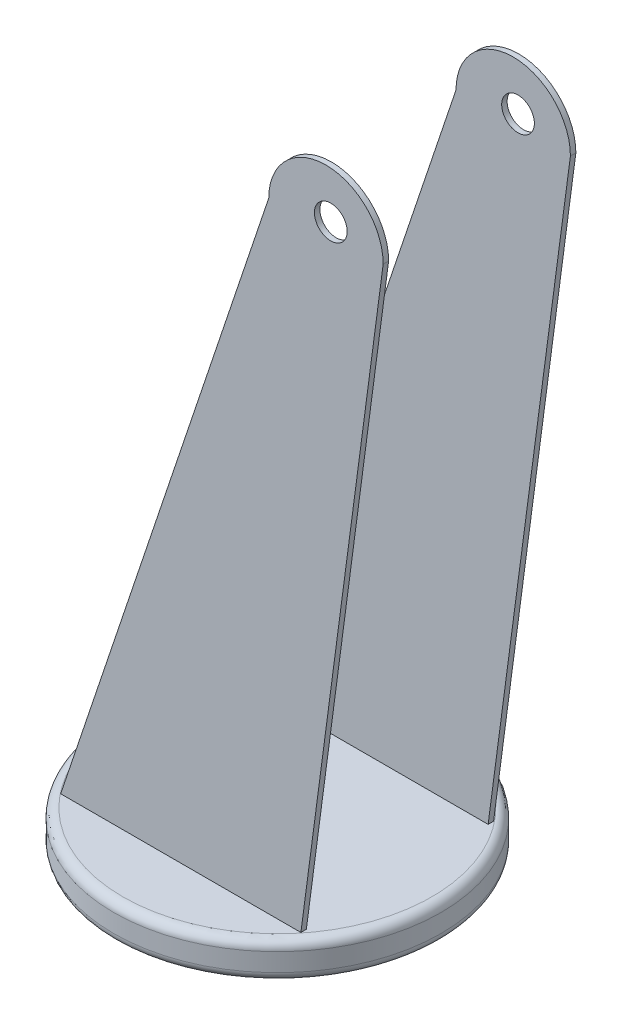
ISO-10303-21;
HEADER;
FILE_DESCRIPTION(('STEP AP214'),'2;1');
FILE_NAME('part.step','',(''),(''),'','','');
FILE_SCHEMA(('AUTOMOTIVE_DESIGN { 1 0 10303 214 1 1 1 1 }'));
ENDSEC;
DATA;
#1=APPLICATION_CONTEXT('core data for automotive mechanical design processes');
#2=APPLICATION_PROTOCOL_DEFINITION('international standard','automotive_design',2000,#1);
#3=PRODUCT_CONTEXT('',#1,'mechanical');
#4=PRODUCT('Part','Part','',(#3));
#5=PRODUCT_RELATED_PRODUCT_CATEGORY('part','',(#4));
#6=PRODUCT_DEFINITION_FORMATION('','',#4);
#7=PRODUCT_DEFINITION_CONTEXT('part definition',#1,'design');
#8=PRODUCT_DEFINITION('design','',#6,#7);
#9=PRODUCT_DEFINITION_SHAPE('','',#8);
#10=(LENGTH_UNIT() NAMED_UNIT(*) SI_UNIT(.MILLI.,.METRE.));
#11=(NAMED_UNIT(*) PLANE_ANGLE_UNIT() SI_UNIT($,.RADIAN.));
#12=(NAMED_UNIT(*) SI_UNIT($,.STERADIAN.) SOLID_ANGLE_UNIT());
#13=UNCERTAINTY_MEASURE_WITH_UNIT(LENGTH_MEASURE(1.E-05),#10,'distance_accuracy_value','');
#14=(GEOMETRIC_REPRESENTATION_CONTEXT(3) GLOBAL_UNCERTAINTY_ASSIGNED_CONTEXT((#13)) GLOBAL_UNIT_ASSIGNED_CONTEXT((#10,
#11,#12)) REPRESENTATION_CONTEXT('',''));
#15=CARTESIAN_POINT('',(0.,0.,0.));
#16=DIRECTION('',(0.,0.,1.));
#17=DIRECTION('',(1.,0.,0.));
#18=AXIS2_PLACEMENT_3D('',#15,#16,#17);
#19=CARTESIAN_POINT('',(0.,2.,0.));
#20=DIRECTION('',(0.,1.,0.));
#21=DIRECTION('',(0.,0.,1.));
#22=AXIS2_PLACEMENT_3D('',#19,#20,#21);
#23=PLANE('',#22);
#24=CARTESIAN_POINT('',(0.,2.,0.));
#25=DIRECTION('',(0.,1.,0.));
#26=DIRECTION('',(0.,0.,1.));
#27=AXIS2_PLACEMENT_3D('',#24,#25,#26);
#28=CIRCLE('',#27,1.);
#29=CARTESIAN_POINT('',(0.,2.,1.));
#30=VERTEX_POINT('',#29);
#31=EDGE_CURVE('E310',#30,#30,#28,.T.);
#32=ORIENTED_EDGE('',*,*,#31,.F.);
#33=EDGE_LOOP('',(#32));
#34=FACE_BOUND('',#33,.T.);
#35=CARTESIAN_POINT('',(0.,2.,0.));
#36=DIRECTION('',(0.,1.,0.));
#37=DIRECTION('',(0.,0.,1.));
#38=AXIS2_PLACEMENT_3D('',#35,#36,#37);
#39=CIRCLE('',#38,8.5);
#40=CARTESIAN_POINT('',(0.,2.,8.5));
#41=VERTEX_POINT('',#40);
#42=EDGE_CURVE('E190',#41,#41,#39,.T.);
#43=ORIENTED_EDGE('',*,*,#42,.T.);
#44=EDGE_LOOP('',(#43));
#45=FACE_BOUND('',#44,.T.);
#46=DIRECTION('',(-1.,0.,0.));
#47=VECTOR('',#46,1.);
#48=CARTESIAN_POINT('',(0.,2.,5.3));
#49=LINE('',#48,#47);
#50=CARTESIAN_POINT('',(6.59378966330085,2.,5.3));
#51=VERTEX_POINT('',#50);
#52=CARTESIAN_POINT('',(-6.62055026115835,2.,5.3));
#53=VERTEX_POINT('',#52);
#54=EDGE_CURVE('E201',#51,#53,#49,.T.);
#55=ORIENTED_EDGE('',*,*,#54,.T.);
#56=DIRECTION('',(0.,0.,-1.));
#57=VECTOR('',#56,1.);
#58=CARTESIAN_POINT('',(-6.62055026115835,2.,0.));
#59=LINE('',#58,#57);
#60=CARTESIAN_POINT('',(-6.62055026115835,2.,5.));
#61=VERTEX_POINT('',#60);
#62=EDGE_CURVE('E205',#53,#61,#59,.T.);
#63=ORIENTED_EDGE('',*,*,#62,.T.);
#64=DIRECTION('',(-1.,0.,0.));
#65=VECTOR('',#64,1.);
#66=CARTESIAN_POINT('',(0.,2.,5.));
#67=LINE('',#66,#65);
#68=CARTESIAN_POINT('',(6.59378966330084,2.,5.));
#69=VERTEX_POINT('',#68);
#70=EDGE_CURVE('E198',#69,#61,#67,.T.);
#71=ORIENTED_EDGE('',*,*,#70,.F.);
#72=DIRECTION('',(0.,0.,1.));
#73=VECTOR('',#72,1.);
#74=CARTESIAN_POINT('',(6.59378966330085,2.,0.));
#75=LINE('',#74,#73);
#76=EDGE_CURVE('E194',#69,#51,#75,.T.);
#77=ORIENTED_EDGE('',*,*,#76,.T.);
#78=EDGE_LOOP('',(#55,#63,#71,#77));
#79=FACE_BOUND('',#78,.T.);
#80=DIRECTION('',(0.,0.,1.));
#81=VECTOR('',#80,1.);
#82=CARTESIAN_POINT('',(-6.62055026115835,2.,0.));
#83=LINE('',#82,#81);
#84=CARTESIAN_POINT('',(-6.62055026115835,2.,-5.3));
#85=VERTEX_POINT('',#84);
#86=CARTESIAN_POINT('',(-6.62055026115835,2.,-5.));
#87=VERTEX_POINT('',#86);
#88=EDGE_CURVE('E48',#85,#87,#83,.T.);
#89=ORIENTED_EDGE('',*,*,#88,.F.);
#90=DIRECTION('',(1.,0.,0.));
#91=VECTOR('',#90,1.);
#92=CARTESIAN_POINT('',(0.,2.,-5.3));
#93=LINE('',#92,#91);
#94=CARTESIAN_POINT('',(6.59378966330085,2.,-5.3));
#95=VERTEX_POINT('',#94);
#96=EDGE_CURVE('E11',#85,#95,#93,.T.);
#97=ORIENTED_EDGE('',*,*,#96,.T.);
#98=DIRECTION('',(0.,0.,-1.));
#99=VECTOR('',#98,1.);
#100=CARTESIAN_POINT('',(6.59378966330085,2.,0.));
#101=LINE('',#100,#99);
#102=CARTESIAN_POINT('',(6.59378966330084,2.,-5.));
#103=VERTEX_POINT('',#102);
#104=EDGE_CURVE('E213',#103,#95,#101,.T.);
#105=ORIENTED_EDGE('',*,*,#104,.F.);
#106=DIRECTION('',(1.,0.,0.));
#107=VECTOR('',#106,1.);
#108=CARTESIAN_POINT('',(0.,2.,-5.));
#109=LINE('',#108,#107);
#110=EDGE_CURVE('E209',#87,#103,#109,.T.);
#111=ORIENTED_EDGE('',*,*,#110,.F.);
#112=EDGE_LOOP('',(#89,#97,#105,#111));
#113=FACE_BOUND('',#112,.T.);
#114=ADVANCED_FACE('F39',(#34,#45,#79,#113),#23,.T.);
#115=CARTESIAN_POINT('',(0.,2.,0.));
#116=DIRECTION('',(0.,-1.,0.));
#117=DIRECTION('',(0.,0.,-1.));
#118=AXIS2_PLACEMENT_3D('',#115,#116,#117);
#119=CYLINDRICAL_SURFACE('',#118,9.);
#120=CARTESIAN_POINT('',(0.,0.5,0.));
#121=DIRECTION('',(0.,1.,0.));
#122=DIRECTION('',(0.,0.,1.));
#123=AXIS2_PLACEMENT_3D('',#120,#121,#122);
#124=CIRCLE('',#123,9.);
#125=CARTESIAN_POINT('',(0.,0.5,9.));
#126=VERTEX_POINT('',#125);
#127=EDGE_CURVE('E182',#126,#126,#124,.T.);
#128=ORIENTED_EDGE('',*,*,#127,.T.);
#129=EDGE_LOOP('',(#128));
#130=FACE_BOUND('',#129,.T.);
#131=CARTESIAN_POINT('',(0.,1.5,0.));
#132=DIRECTION('',(0.,1.,0.));
#133=DIRECTION('',(0.,0.,1.));
#134=AXIS2_PLACEMENT_3D('',#131,#132,#133);
#135=CIRCLE('',#134,9.);
#136=CARTESIAN_POINT('',(0.,1.5,9.));
#137=VERTEX_POINT('',#136);
#138=EDGE_CURVE('E178',#137,#137,#135,.F.);
#139=ORIENTED_EDGE('',*,*,#138,.T.);
#140=EDGE_LOOP('',(#139));
#141=FACE_BOUND('',#140,.T.);
#142=ADVANCED_FACE('F222',(#130,#141),#119,.T.);
#143=CARTESIAN_POINT('',(0.,0.,0.));
#144=DIRECTION('',(0.,1.,0.));
#145=DIRECTION('',(0.,0.,1.));
#146=AXIS2_PLACEMENT_3D('',#143,#144,#145);
#147=PLANE('',#146);
#148=CARTESIAN_POINT('',(0.,0.,0.));
#149=DIRECTION('',(0.,-1.,0.));
#150=DIRECTION('',(0.,0.,-1.));
#151=AXIS2_PLACEMENT_3D('',#148,#149,#150);
#152=CIRCLE('',#151,1.);
#153=CARTESIAN_POINT('',(0.,0.,-1.));
#154=VERTEX_POINT('',#153);
#155=EDGE_CURVE('E313',#154,#154,#152,.T.);
#156=ORIENTED_EDGE('',*,*,#155,.F.);
#157=EDGE_LOOP('',(#156));
#158=FACE_BOUND('',#157,.T.);
#159=CARTESIAN_POINT('',(0.,0.,0.));
#160=DIRECTION('',(0.,1.,0.));
#161=DIRECTION('',(0.,0.,1.));
#162=AXIS2_PLACEMENT_3D('',#159,#160,#161);
#163=CIRCLE('',#162,8.5);
#164=CARTESIAN_POINT('',(0.,0.,8.5));
#165=VERTEX_POINT('',#164);
#166=EDGE_CURVE('E186',#165,#165,#163,.F.);
#167=ORIENTED_EDGE('',*,*,#166,.T.);
#168=EDGE_LOOP('',(#167));
#169=FACE_BOUND('',#168,.T.);
#170=ADVANCED_FACE('F228',(#158,#169),#147,.F.);
#171=CARTESIAN_POINT('',(0.,0.5,0.));
#172=DIRECTION('',(0.,1.,0.));
#173=DIRECTION('',(0.,0.,1.));
#174=AXIS2_PLACEMENT_3D('',#171,#172,#173);
#175=TOROIDAL_SURFACE('',#174,8.5,0.5);
#176=ORIENTED_EDGE('',*,*,#166,.F.);
#177=EDGE_LOOP('',(#176));
#178=FACE_BOUND('',#177,.T.);
#179=ORIENTED_EDGE('',*,*,#127,.F.);
#180=EDGE_LOOP('',(#179));
#181=FACE_BOUND('',#180,.T.);
#182=ADVANCED_FACE('F238',(#178,#181),#175,.T.);
#183=CARTESIAN_POINT('',(0.,1.5,0.));
#184=DIRECTION('',(0.,1.,0.));
#185=DIRECTION('',(0.,0.,1.));
#186=AXIS2_PLACEMENT_3D('',#183,#184,#185);
#187=TOROIDAL_SURFACE('',#186,8.5,0.5);
#188=ORIENTED_EDGE('',*,*,#138,.F.);
#189=EDGE_LOOP('',(#188));
#190=FACE_BOUND('',#189,.T.);
#191=ORIENTED_EDGE('',*,*,#42,.F.);
#192=EDGE_LOOP('',(#191));
#193=FACE_BOUND('',#192,.T.);
#194=ADVANCED_FACE('F41',(#190,#193),#187,.T.);
#195=CARTESIAN_POINT('',(7.97370832583108,36.1053153887784,5.3));
#196=DIRECTION('',(0.,0.,-1.));
#197=DIRECTION('',(-1.,0.,0.));
#198=AXIS2_PLACEMENT_3D('',#195,#196,#197);
#199=PLANE('',#198);
#200=ORIENTED_EDGE('',*,*,#54,.F.);
#201=DIRECTION('',(0.13158115042546,0.991305402412754,0.));
#202=VECTOR('',#201,1.);
#203=CARTESIAN_POINT('',(6.54986348940184,1.66906921430154,5.3));
#204=LINE('',#203,#202);
#205=CARTESIAN_POINT('',(11.1207665400092,36.1053153887784,5.3));
#206=VERTEX_POINT('',#205);
#207=EDGE_CURVE('E155',#51,#206,#204,.T.);
#208=ORIENTED_EDGE('',*,*,#207,.T.);
#209=CARTESIAN_POINT('',(7.97370832583108,36.1053153887784,5.3));
#210=DIRECTION('',(0.,0.,1.));
#211=DIRECTION('',(-1.,0.,0.));
#212=AXIS2_PLACEMENT_3D('',#209,#210,#211);
#213=CIRCLE('',#212,3.14705821417813);
#214=CARTESIAN_POINT('',(4.82665011165295,36.1053153887784,5.3));
#215=VERTEX_POINT('',#214);
#216=EDGE_CURVE('E159',#206,#215,#213,.T.);
#217=ORIENTED_EDGE('',*,*,#216,.T.);
#218=DIRECTION('',(-0.318197492172726,-0.948024449038625,0.));
#219=VECTOR('',#218,1.);
#220=CARTESIAN_POINT('',(-6.73162476582834,1.66906921430154,5.3));
#221=LINE('',#220,#219);
#222=EDGE_CURVE('E151',#215,#53,#221,.T.);
#223=ORIENTED_EDGE('',*,*,#222,.T.);
#224=EDGE_LOOP('',(#200,#208,#217,#223));
#225=FACE_BOUND('',#224,.T.);
#226=CARTESIAN_POINT('',(8.23888263377911,36.6690692143015,5.3));
#227=DIRECTION('',(0.,0.,1.));
#228=DIRECTION('',(1.,0.,0.));
#229=AXIS2_PLACEMENT_3D('',#226,#227,#228);
#230=CIRCLE('',#229,0.9);
#231=CARTESIAN_POINT('',(9.13888263377912,36.6690692143015,5.3));
#232=VERTEX_POINT('',#231);
#233=EDGE_CURVE('E143',#232,#232,#230,.T.);
#234=ORIENTED_EDGE('',*,*,#233,.F.);
#235=EDGE_LOOP('',(#234));
#236=FACE_BOUND('',#235,.T.);
#237=ADVANCED_FACE('F245',(#225,#236),#199,.F.);
#238=CARTESIAN_POINT('',(7.97370832583108,36.1053153887784,5.));
#239=DIRECTION('',(0.,0.,-1.));
#240=DIRECTION('',(-1.,0.,0.));
#241=AXIS2_PLACEMENT_3D('',#238,#239,#240);
#242=PLANE('',#241);
#243=DIRECTION('',(0.13158115042546,0.991305402412754,0.));
#244=VECTOR('',#243,1.);
#245=CARTESIAN_POINT('',(6.54986348940184,1.66906921430154,5.));
#246=LINE('',#245,#244);
#247=CARTESIAN_POINT('',(11.1207665400092,36.1053153887784,5.));
#248=VERTEX_POINT('',#247);
#249=EDGE_CURVE('E166',#69,#248,#246,.T.);
#250=ORIENTED_EDGE('',*,*,#249,.F.);
#251=ORIENTED_EDGE('',*,*,#70,.T.);
#252=DIRECTION('',(-0.318197492172726,-0.948024449038625,0.));
#253=VECTOR('',#252,1.);
#254=CARTESIAN_POINT('',(-6.73162476582834,1.66906921430154,5.));
#255=LINE('',#254,#253);
#256=CARTESIAN_POINT('',(4.82665011165295,36.1053153887784,5.));
#257=VERTEX_POINT('',#256);
#258=EDGE_CURVE('E147',#257,#61,#255,.T.);
#259=ORIENTED_EDGE('',*,*,#258,.F.);
#260=CARTESIAN_POINT('',(7.97370832583108,36.1053153887784,5.));
#261=DIRECTION('',(0.,0.,1.));
#262=DIRECTION('',(-1.,0.,0.));
#263=AXIS2_PLACEMENT_3D('',#260,#261,#262);
#264=CIRCLE('',#263,3.14705821417813);
#265=EDGE_CURVE('E156',#248,#257,#264,.T.);
#266=ORIENTED_EDGE('',*,*,#265,.F.);
#267=EDGE_LOOP('',(#250,#251,#259,#266));
#268=FACE_BOUND('',#267,.T.);
#269=CARTESIAN_POINT('',(8.23888263377911,36.6690692143015,5.));
#270=DIRECTION('',(0.,0.,1.));
#271=DIRECTION('',(1.,0.,0.));
#272=AXIS2_PLACEMENT_3D('',#269,#270,#271);
#273=CIRCLE('',#272,0.9);
#274=CARTESIAN_POINT('',(9.13888263377912,36.6690692143015,5.));
#275=VERTEX_POINT('',#274);
#276=EDGE_CURVE('E111',#275,#275,#273,.T.);
#277=ORIENTED_EDGE('',*,*,#276,.T.);
#278=EDGE_LOOP('',(#277));
#279=FACE_BOUND('',#278,.T.);
#280=ADVANCED_FACE('F268',(#268,#279),#242,.T.);
#281=CARTESIAN_POINT('',(-6.73162476582834,1.66906921430154,5.3));
#282=DIRECTION('',(0.948024449038625,-0.318197492172726,0.));
#283=DIRECTION('',(0.318197492172726,0.948024449038625,0.));
#284=AXIS2_PLACEMENT_3D('',#281,#282,#283);
#285=PLANE('',#284);
#286=ORIENTED_EDGE('',*,*,#62,.F.);
#287=ORIENTED_EDGE('',*,*,#222,.F.);
#288=DIRECTION('',(0.,0.,-1.));
#289=VECTOR('',#288,1.);
#290=CARTESIAN_POINT('',(4.82665011165295,36.1053153887784,5.3));
#291=LINE('',#290,#289);
#292=EDGE_CURVE('E162',#215,#257,#291,.T.);
#293=ORIENTED_EDGE('',*,*,#292,.T.);
#294=ORIENTED_EDGE('',*,*,#258,.T.);
#295=EDGE_LOOP('',(#286,#287,#293,#294));
#296=FACE_BOUND('',#295,.T.);
#297=ADVANCED_FACE('F235',(#296),#285,.F.);
#298=CARTESIAN_POINT('',(6.54986348940184,1.66906921430154,5.3));
#299=DIRECTION('',(-0.991305402412754,0.13158115042546,0.));
#300=DIRECTION('',(-0.13158115042546,-0.991305402412754,0.));
#301=AXIS2_PLACEMENT_3D('',#298,#299,#300);
#302=PLANE('',#301);
#303=ORIENTED_EDGE('',*,*,#76,.F.);
#304=ORIENTED_EDGE('',*,*,#249,.T.);
#305=DIRECTION('',(0.,0.,-1.));
#306=VECTOR('',#305,1.);
#307=CARTESIAN_POINT('',(11.1207665400092,36.1053153887784,5.3));
#308=LINE('',#307,#306);
#309=EDGE_CURVE('E174',#206,#248,#308,.T.);
#310=ORIENTED_EDGE('',*,*,#309,.F.);
#311=ORIENTED_EDGE('',*,*,#207,.F.);
#312=EDGE_LOOP('',(#303,#304,#310,#311));
#313=FACE_BOUND('',#312,.T.);
#314=ADVANCED_FACE('F271',(#313),#302,.F.);
#315=CARTESIAN_POINT('',(7.97370832583108,36.1053153887784,5.3));
#316=DIRECTION('',(0.,0.,-1.));
#317=DIRECTION('',(-1.,0.,0.));
#318=AXIS2_PLACEMENT_3D('',#315,#316,#317);
#319=CYLINDRICAL_SURFACE('',#318,3.14705821417813);
#320=ORIENTED_EDGE('',*,*,#265,.T.);
#321=ORIENTED_EDGE('',*,*,#292,.F.);
#322=ORIENTED_EDGE('',*,*,#216,.F.);
#323=ORIENTED_EDGE('',*,*,#309,.T.);
#324=EDGE_LOOP('',(#320,#321,#322,#323));
#325=FACE_BOUND('',#324,.T.);
#326=ADVANCED_FACE('F273',(#325),#319,.T.);
#327=CARTESIAN_POINT('',(8.23888263377911,36.6690692143015,5.3));
#328=DIRECTION('',(0.,0.,-1.));
#329=DIRECTION('',(-1.,0.,0.));
#330=AXIS2_PLACEMENT_3D('',#327,#328,#329);
#331=CYLINDRICAL_SURFACE('',#330,0.9);
#332=ORIENTED_EDGE('',*,*,#233,.T.);
#333=EDGE_LOOP('',(#332));
#334=FACE_BOUND('',#333,.T.);
#335=ORIENTED_EDGE('',*,*,#276,.F.);
#336=EDGE_LOOP('',(#335));
#337=FACE_BOUND('',#336,.T.);
#338=ADVANCED_FACE('F275',(#334,#337),#331,.F.);
#339=CARTESIAN_POINT('',(-6.73162476582834,1.66906921430154,-5.3));
#340=DIRECTION('',(-0.948024449038625,0.318197492172726,0.));
#341=DIRECTION('',(-0.318197492172726,-0.948024449038625,0.));
#342=AXIS2_PLACEMENT_3D('',#339,#340,#341);
#343=PLANE('',#342);
#344=DIRECTION('',(-0.318197492172726,-0.948024449038625,0.));
#345=VECTOR('',#344,1.);
#346=CARTESIAN_POINT('',(-6.73162476582834,1.66906921430154,-5.3));
#347=LINE('',#346,#345);
#348=CARTESIAN_POINT('',(4.82665011165295,36.1053153887784,-5.3));
#349=VERTEX_POINT('',#348);
#350=EDGE_CURVE('E103',#349,#85,#347,.T.);
#351=ORIENTED_EDGE('',*,*,#350,.T.);
#352=ORIENTED_EDGE('',*,*,#88,.T.);
#353=DIRECTION('',(-0.318197492172726,-0.948024449038625,0.));
#354=VECTOR('',#353,1.);
#355=CARTESIAN_POINT('',(-6.73162476582834,1.66906921430154,-5.));
#356=LINE('',#355,#354);
#357=CARTESIAN_POINT('',(4.82665011165295,36.1053153887784,-5.));
#358=VERTEX_POINT('',#357);
#359=EDGE_CURVE('E105',#358,#87,#356,.T.);
#360=ORIENTED_EDGE('',*,*,#359,.F.);
#361=DIRECTION('',(0.,0.,1.));
#362=VECTOR('',#361,1.);
#363=CARTESIAN_POINT('',(4.82665011165295,36.1053153887784,-5.3));
#364=LINE('',#363,#362);
#365=EDGE_CURVE('E100',#349,#358,#364,.T.);
#366=ORIENTED_EDGE('',*,*,#365,.F.);
#367=EDGE_LOOP('',(#351,#352,#360,#366));
#368=FACE_BOUND('',#367,.T.);
#369=ADVANCED_FACE('F102',(#368),#343,.T.);
#370=CARTESIAN_POINT('',(7.97370832583108,36.1053153887784,-5.3));
#371=DIRECTION('',(0.,0.,1.));
#372=DIRECTION('',(1.,0.,0.));
#373=AXIS2_PLACEMENT_3D('',#370,#371,#372);
#374=CYLINDRICAL_SURFACE('',#373,3.14705821417813);
#375=CARTESIAN_POINT('',(7.97370832583108,36.1053153887784,-5.));
#376=DIRECTION('',(0.,0.,1.));
#377=DIRECTION('',(-1.,0.,0.));
#378=AXIS2_PLACEMENT_3D('',#375,#376,#377);
#379=CIRCLE('',#378,3.14705821417813);
#380=CARTESIAN_POINT('',(11.1207665400092,36.1053153887784,-5.));
#381=VERTEX_POINT('',#380);
#382=EDGE_CURVE('E135',#381,#358,#379,.T.);
#383=ORIENTED_EDGE('',*,*,#382,.F.);
#384=DIRECTION('',(0.,0.,1.));
#385=VECTOR('',#384,1.);
#386=CARTESIAN_POINT('',(11.1207665400092,36.1053153887784,-5.3));
#387=LINE('',#386,#385);
#388=CARTESIAN_POINT('',(11.1207665400092,36.1053153887784,-5.3));
#389=VERTEX_POINT('',#388);
#390=EDGE_CURVE('E112',#389,#381,#387,.T.);
#391=ORIENTED_EDGE('',*,*,#390,.F.);
#392=CARTESIAN_POINT('',(7.97370832583108,36.1053153887784,-5.3));
#393=DIRECTION('',(0.,0.,1.));
#394=DIRECTION('',(-1.,0.,0.));
#395=AXIS2_PLACEMENT_3D('',#392,#393,#394);
#396=CIRCLE('',#395,3.14705821417813);
#397=EDGE_CURVE('E119',#389,#349,#396,.T.);
#398=ORIENTED_EDGE('',*,*,#397,.T.);
#399=ORIENTED_EDGE('',*,*,#365,.T.);
#400=EDGE_LOOP('',(#383,#391,#398,#399));
#401=FACE_BOUND('',#400,.T.);
#402=ADVANCED_FACE('F124',(#401),#374,.T.);
#403=CARTESIAN_POINT('',(6.54986348940184,1.66906921430154,-5.3));
#404=DIRECTION('',(0.991305402412754,-0.13158115042546,0.));
#405=DIRECTION('',(0.13158115042546,0.991305402412754,0.));
#406=AXIS2_PLACEMENT_3D('',#403,#404,#405);
#407=PLANE('',#406);
#408=DIRECTION('',(0.13158115042546,0.991305402412754,0.));
#409=VECTOR('',#408,1.);
#410=CARTESIAN_POINT('',(6.54986348940184,1.66906921430154,-5.));
#411=LINE('',#410,#409);
#412=EDGE_CURVE('E121',#103,#381,#411,.T.);
#413=ORIENTED_EDGE('',*,*,#412,.F.);
#414=ORIENTED_EDGE('',*,*,#104,.T.);
#415=DIRECTION('',(0.13158115042546,0.991305402412754,0.));
#416=VECTOR('',#415,1.);
#417=CARTESIAN_POINT('',(6.54986348940184,1.66906921430154,-5.3));
#418=LINE('',#417,#416);
#419=EDGE_CURVE('E127',#95,#389,#418,.T.);
#420=ORIENTED_EDGE('',*,*,#419,.T.);
#421=ORIENTED_EDGE('',*,*,#390,.T.);
#422=EDGE_LOOP('',(#413,#414,#420,#421));
#423=FACE_BOUND('',#422,.T.);
#424=ADVANCED_FACE('F220',(#423),#407,.T.);
#425=CARTESIAN_POINT('',(7.97370832583108,36.1053153887784,-5.3));
#426=DIRECTION('',(0.,0.,1.));
#427=DIRECTION('',(-1.,0.,0.));
#428=AXIS2_PLACEMENT_3D('',#425,#426,#427);
#429=PLANE('',#428);
#430=ORIENTED_EDGE('',*,*,#96,.F.);
#431=ORIENTED_EDGE('',*,*,#350,.F.);
#432=ORIENTED_EDGE('',*,*,#397,.F.);
#433=ORIENTED_EDGE('',*,*,#419,.F.);
#434=EDGE_LOOP('',(#430,#431,#432,#433));
#435=FACE_BOUND('',#434,.T.);
#436=CARTESIAN_POINT('',(8.23888263377911,36.6690692143015,-5.3));
#437=DIRECTION('',(0.,0.,1.));
#438=DIRECTION('',(1.,0.,0.));
#439=AXIS2_PLACEMENT_3D('',#436,#437,#438);
#440=CIRCLE('',#439,0.9);
#441=CARTESIAN_POINT('',(9.13888263377912,36.6690692143015,-5.3));
#442=VERTEX_POINT('',#441);
#443=EDGE_CURVE('E136',#442,#442,#440,.T.);
#444=ORIENTED_EDGE('',*,*,#443,.T.);
#445=EDGE_LOOP('',(#444));
#446=FACE_BOUND('',#445,.T.);
#447=ADVANCED_FACE('F116',(#435,#446),#429,.F.);
#448=CARTESIAN_POINT('',(7.97370832583108,36.1053153887784,-5.));
#449=DIRECTION('',(0.,0.,1.));
#450=DIRECTION('',(-1.,0.,0.));
#451=AXIS2_PLACEMENT_3D('',#448,#449,#450);
#452=PLANE('',#451);
#453=CARTESIAN_POINT('',(8.23888263377911,36.6690692143015,-5.));
#454=DIRECTION('',(0.,0.,1.));
#455=DIRECTION('',(1.,0.,0.));
#456=AXIS2_PLACEMENT_3D('',#453,#454,#455);
#457=CIRCLE('',#456,0.9);
#458=CARTESIAN_POINT('',(9.13888263377912,36.6690692143015,-5.));
#459=VERTEX_POINT('',#458);
#460=EDGE_CURVE('E317',#459,#459,#457,.T.);
#461=ORIENTED_EDGE('',*,*,#460,.F.);
#462=EDGE_LOOP('',(#461));
#463=FACE_BOUND('',#462,.T.);
#464=ORIENTED_EDGE('',*,*,#359,.T.);
#465=ORIENTED_EDGE('',*,*,#110,.T.);
#466=ORIENTED_EDGE('',*,*,#412,.T.);
#467=ORIENTED_EDGE('',*,*,#382,.T.);
#468=EDGE_LOOP('',(#464,#465,#466,#467));
#469=FACE_BOUND('',#468,.T.);
#470=ADVANCED_FACE('F217',(#463,#469),#452,.T.);
#471=CARTESIAN_POINT('',(8.23888263377911,36.6690692143015,-5.3));
#472=DIRECTION('',(0.,0.,1.));
#473=DIRECTION('',(1.,0.,0.));
#474=AXIS2_PLACEMENT_3D('',#471,#472,#473);
#475=CYLINDRICAL_SURFACE('',#474,0.9);
#476=ORIENTED_EDGE('',*,*,#443,.F.);
#477=EDGE_LOOP('',(#476));
#478=FACE_BOUND('',#477,.T.);
#479=ORIENTED_EDGE('',*,*,#460,.T.);
#480=EDGE_LOOP('',(#479));
#481=FACE_BOUND('',#480,.T.);
#482=ADVANCED_FACE('F296',(#478,#481),#475,.F.);
#483=CARTESIAN_POINT('',(0.,39.2523736029565,0.));
#484=DIRECTION('',(0.,-1.,0.));
#485=DIRECTION('',(0.,0.,-1.));
#486=AXIS2_PLACEMENT_3D('',#483,#484,#485);
#487=CYLINDRICAL_SURFACE('',#486,1.);
#488=ORIENTED_EDGE('',*,*,#31,.T.);
#489=EDGE_LOOP('',(#488));
#490=FACE_BOUND('',#489,.T.);
#491=ORIENTED_EDGE('',*,*,#155,.T.);
#492=EDGE_LOOP('',(#491));
#493=FACE_BOUND('',#492,.T.);
#494=ADVANCED_FACE('F302',(#490,#493),#487,.F.);
#495=CLOSED_SHELL('',(#114,#142,#170,#182,#194,#237,#280,#297,#314,#326,#338,#369,#402,#424,
#447,#470,#482,#494));
#496=MANIFOLD_SOLID_BREP('B2',#495);
#497=ADVANCED_BREP_SHAPE_REPRESENTATION('',(#18,#496),#14);
#498=SHAPE_DEFINITION_REPRESENTATION(#9,#497);
ENDSEC;
END-ISO-10303-21;
